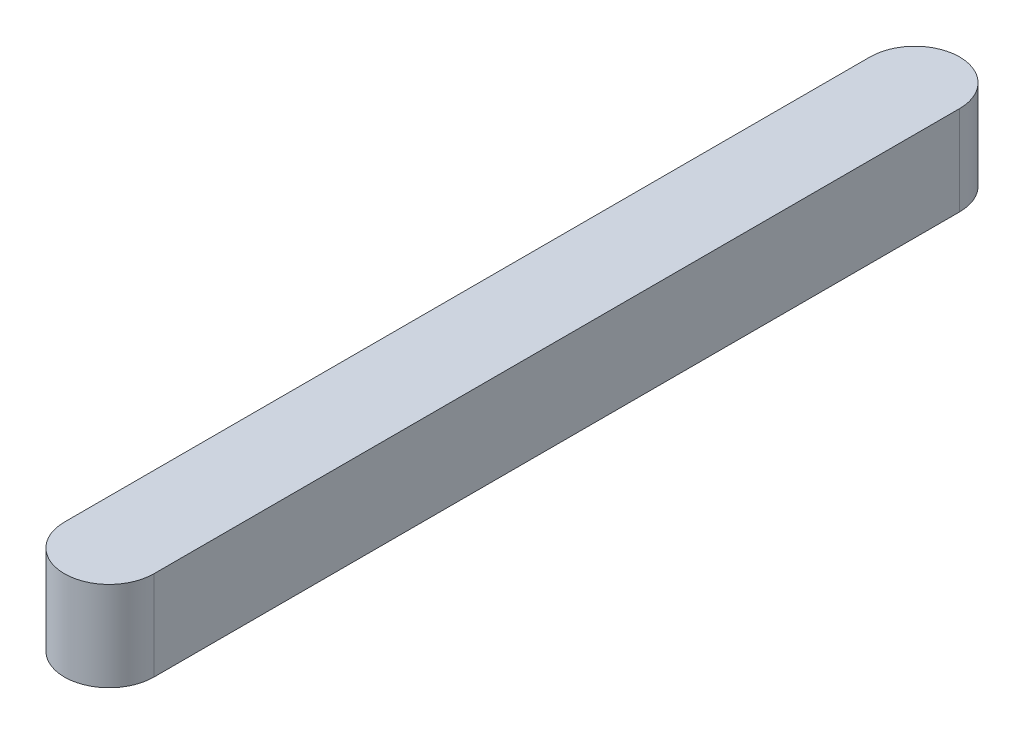
ISO-10303-21;
HEADER;
FILE_DESCRIPTION(('STEP AP214'),'2;1');
FILE_NAME('part.step','',(''),(''),'','','');
FILE_SCHEMA(('AUTOMOTIVE_DESIGN { 1 0 10303 214 1 1 1 1 }'));
ENDSEC;
DATA;
#1=APPLICATION_CONTEXT('core data for automotive mechanical design processes');
#2=APPLICATION_PROTOCOL_DEFINITION('international standard','automotive_design',2000,#1);
#3=PRODUCT_CONTEXT('',#1,'mechanical');
#4=PRODUCT('Part','Part','',(#3));
#5=PRODUCT_RELATED_PRODUCT_CATEGORY('part','',(#4));
#6=PRODUCT_DEFINITION_FORMATION('','',#4);
#7=PRODUCT_DEFINITION_CONTEXT('part definition',#1,'design');
#8=PRODUCT_DEFINITION('design','',#6,#7);
#9=PRODUCT_DEFINITION_SHAPE('','',#8);
#10=(LENGTH_UNIT() NAMED_UNIT(*) SI_UNIT(.MILLI.,.METRE.));
#11=(NAMED_UNIT(*) PLANE_ANGLE_UNIT() SI_UNIT($,.RADIAN.));
#12=(NAMED_UNIT(*) SI_UNIT($,.STERADIAN.) SOLID_ANGLE_UNIT());
#13=UNCERTAINTY_MEASURE_WITH_UNIT(LENGTH_MEASURE(1.E-05),#10,'distance_accuracy_value','');
#14=(GEOMETRIC_REPRESENTATION_CONTEXT(3) GLOBAL_UNCERTAINTY_ASSIGNED_CONTEXT((#13)) GLOBAL_UNIT_ASSIGNED_CONTEXT((#10,
#11,#12)) REPRESENTATION_CONTEXT('',''));
#15=CARTESIAN_POINT('',(0.,0.,0.));
#16=DIRECTION('',(0.,0.,1.));
#17=DIRECTION('',(1.,0.,0.));
#18=AXIS2_PLACEMENT_3D('',#15,#16,#17);
#19=CARTESIAN_POINT('',(0.,1.,9.));
#20=DIRECTION('',(0.,-1.,0.));
#21=DIRECTION('',(0.,0.,-1.));
#22=AXIS2_PLACEMENT_3D('',#19,#20,#21);
#23=CYLINDRICAL_SURFACE('',#22,1.);
#24=CARTESIAN_POINT('',(0.,-1.,9.));
#25=DIRECTION('',(0.,-1.,0.));
#26=DIRECTION('',(0.,0.,-1.));
#27=AXIS2_PLACEMENT_3D('',#24,#25,#26);
#28=CIRCLE('',#27,1.);
#29=CARTESIAN_POINT('',(-1.,-1.,9.));
#30=VERTEX_POINT('',#29);
#31=CARTESIAN_POINT('',(1.,-1.,9.));
#32=VERTEX_POINT('',#31);
#33=EDGE_CURVE('E19',#30,#32,#28,.F.);
#34=ORIENTED_EDGE('',*,*,#33,.T.);
#35=DIRECTION('',(0.,1.,0.));
#36=VECTOR('',#35,1.);
#37=CARTESIAN_POINT('',(1.,-1.,9.));
#38=LINE('',#37,#36);
#39=CARTESIAN_POINT('',(1.,1.,9.));
#40=VERTEX_POINT('',#39);
#41=EDGE_CURVE('E75',#32,#40,#38,.T.);
#42=ORIENTED_EDGE('',*,*,#41,.T.);
#43=CARTESIAN_POINT('',(0.,1.,9.));
#44=DIRECTION('',(0.,-1.,0.));
#45=DIRECTION('',(0.,0.,-1.));
#46=AXIS2_PLACEMENT_3D('',#43,#44,#45);
#47=CIRCLE('',#46,1.);
#48=CARTESIAN_POINT('',(-1.,1.,9.));
#49=VERTEX_POINT('',#48);
#50=EDGE_CURVE('E63',#40,#49,#47,.T.);
#51=ORIENTED_EDGE('',*,*,#50,.T.);
#52=DIRECTION('',(0.,1.,0.));
#53=VECTOR('',#52,1.);
#54=CARTESIAN_POINT('',(-1.,-1.,9.));
#55=LINE('',#54,#53);
#56=EDGE_CURVE('E82',#49,#30,#55,.F.);
#57=ORIENTED_EDGE('',*,*,#56,.T.);
#58=EDGE_LOOP('',(#34,#42,#51,#57));
#59=FACE_BOUND('',#58,.T.);
#60=ADVANCED_FACE('F16',(#59),#23,.T.);
#61=CARTESIAN_POINT('',(0.,-1.,-9.));
#62=DIRECTION('',(0.,1.,0.));
#63=DIRECTION('',(0.,0.,1.));
#64=AXIS2_PLACEMENT_3D('',#61,#62,#63);
#65=CYLINDRICAL_SURFACE('',#64,0.999999999999999);
#66=CARTESIAN_POINT('',(0.,-1.,-9.));
#67=DIRECTION('',(0.,1.,0.));
#68=DIRECTION('',(0.,0.,1.));
#69=AXIS2_PLACEMENT_3D('',#66,#67,#68);
#70=CIRCLE('',#69,0.999999999999999);
#71=CARTESIAN_POINT('',(1.,-1.,-9.));
#72=VERTEX_POINT('',#71);
#73=CARTESIAN_POINT('',(-1.,-1.,-9.));
#74=VERTEX_POINT('',#73);
#75=EDGE_CURVE('E34',#72,#74,#70,.T.);
#76=ORIENTED_EDGE('',*,*,#75,.T.);
#77=DIRECTION('',(0.,1.,0.));
#78=VECTOR('',#77,1.);
#79=CARTESIAN_POINT('',(-1.,-1.,-9.));
#80=LINE('',#79,#78);
#81=CARTESIAN_POINT('',(-1.,1.,-9.));
#82=VERTEX_POINT('',#81);
#83=EDGE_CURVE('E85',#74,#82,#80,.T.);
#84=ORIENTED_EDGE('',*,*,#83,.T.);
#85=CARTESIAN_POINT('',(0.,1.,-9.));
#86=DIRECTION('',(0.,-1.,0.));
#87=DIRECTION('',(0.,0.,-1.));
#88=AXIS2_PLACEMENT_3D('',#85,#86,#87);
#89=CIRCLE('',#88,0.999999999999999);
#90=CARTESIAN_POINT('',(1.,1.,-9.));
#91=VERTEX_POINT('',#90);
#92=EDGE_CURVE('E55',#82,#91,#89,.T.);
#93=ORIENTED_EDGE('',*,*,#92,.T.);
#94=DIRECTION('',(0.,1.,0.));
#95=VECTOR('',#94,1.);
#96=CARTESIAN_POINT('',(1.,-1.,-9.));
#97=LINE('',#96,#95);
#98=EDGE_CURVE('E76',#91,#72,#97,.F.);
#99=ORIENTED_EDGE('',*,*,#98,.T.);
#100=EDGE_LOOP('',(#76,#84,#93,#99));
#101=FACE_BOUND('',#100,.T.);
#102=ADVANCED_FACE('F90',(#101),#65,.T.);
#103=CARTESIAN_POINT('',(-1.,1.,10.));
#104=DIRECTION('',(0.,-1.,0.));
#105=DIRECTION('',(0.,0.,-1.));
#106=AXIS2_PLACEMENT_3D('',#103,#104,#105);
#107=PLANE('',#106);
#108=ORIENTED_EDGE('',*,*,#92,.F.);
#109=DIRECTION('',(0.,0.,-1.));
#110=VECTOR('',#109,1.);
#111=CARTESIAN_POINT('',(-1.,1.,10.));
#112=LINE('',#111,#110);
#113=EDGE_CURVE('E67',#82,#49,#112,.F.);
#114=ORIENTED_EDGE('',*,*,#113,.T.);
#115=ORIENTED_EDGE('',*,*,#50,.F.);
#116=DIRECTION('',(0.,0.,1.));
#117=VECTOR('',#116,1.);
#118=CARTESIAN_POINT('',(1.,1.,10.));
#119=LINE('',#118,#117);
#120=EDGE_CURVE('E66',#40,#91,#119,.F.);
#121=ORIENTED_EDGE('',*,*,#120,.T.);
#122=EDGE_LOOP('',(#108,#114,#115,#121));
#123=FACE_BOUND('',#122,.T.);
#124=ADVANCED_FACE('F65',(#123),#107,.F.);
#125=CARTESIAN_POINT('',(1.,-1.,10.));
#126=DIRECTION('',(-1.,0.,0.));
#127=DIRECTION('',(0.,0.,1.));
#128=AXIS2_PLACEMENT_3D('',#125,#126,#127);
#129=PLANE('',#128);
#130=ORIENTED_EDGE('',*,*,#98,.F.);
#131=ORIENTED_EDGE('',*,*,#120,.F.);
#132=ORIENTED_EDGE('',*,*,#41,.F.);
#133=DIRECTION('',(0.,0.,1.));
#134=VECTOR('',#133,1.);
#135=CARTESIAN_POINT('',(1.,-1.,10.));
#136=LINE('',#135,#134);
#137=EDGE_CURVE('E25',#32,#72,#136,.F.);
#138=ORIENTED_EDGE('',*,*,#137,.T.);
#139=EDGE_LOOP('',(#130,#131,#132,#138));
#140=FACE_BOUND('',#139,.T.);
#141=ADVANCED_FACE('F73',(#140),#129,.F.);
#142=CARTESIAN_POINT('',(-1.,-1.,10.));
#143=DIRECTION('',(1.,0.,0.));
#144=DIRECTION('',(0.,0.,-1.));
#145=AXIS2_PLACEMENT_3D('',#142,#143,#144);
#146=PLANE('',#145);
#147=ORIENTED_EDGE('',*,*,#83,.F.);
#148=DIRECTION('',(0.,0.,1.));
#149=VECTOR('',#148,1.);
#150=CARTESIAN_POINT('',(-1.,-1.,10.));
#151=LINE('',#150,#149);
#152=EDGE_CURVE('E11',#74,#30,#151,.T.);
#153=ORIENTED_EDGE('',*,*,#152,.T.);
#154=ORIENTED_EDGE('',*,*,#56,.F.);
#155=ORIENTED_EDGE('',*,*,#113,.F.);
#156=EDGE_LOOP('',(#147,#153,#154,#155));
#157=FACE_BOUND('',#156,.T.);
#158=ADVANCED_FACE('F88',(#157),#146,.F.);
#159=CARTESIAN_POINT('',(-1.,-1.,10.));
#160=DIRECTION('',(0.,1.,0.));
#161=DIRECTION('',(0.,0.,1.));
#162=AXIS2_PLACEMENT_3D('',#159,#160,#161);
#163=PLANE('',#162);
#164=ORIENTED_EDGE('',*,*,#75,.F.);
#165=ORIENTED_EDGE('',*,*,#137,.F.);
#166=ORIENTED_EDGE('',*,*,#33,.F.);
#167=ORIENTED_EDGE('',*,*,#152,.F.);
#168=EDGE_LOOP('',(#164,#165,#166,#167));
#169=FACE_BOUND('',#168,.T.);
#170=ADVANCED_FACE('F89',(#169),#163,.F.);
#171=CLOSED_SHELL('',(#60,#102,#124,#141,#158,#170));
#172=MANIFOLD_SOLID_BREP('B1',#171);
#173=ADVANCED_BREP_SHAPE_REPRESENTATION('',(#18,#172),#14);
#174=SHAPE_DEFINITION_REPRESENTATION(#9,#173);
ENDSEC;
END-ISO-10303-21;
